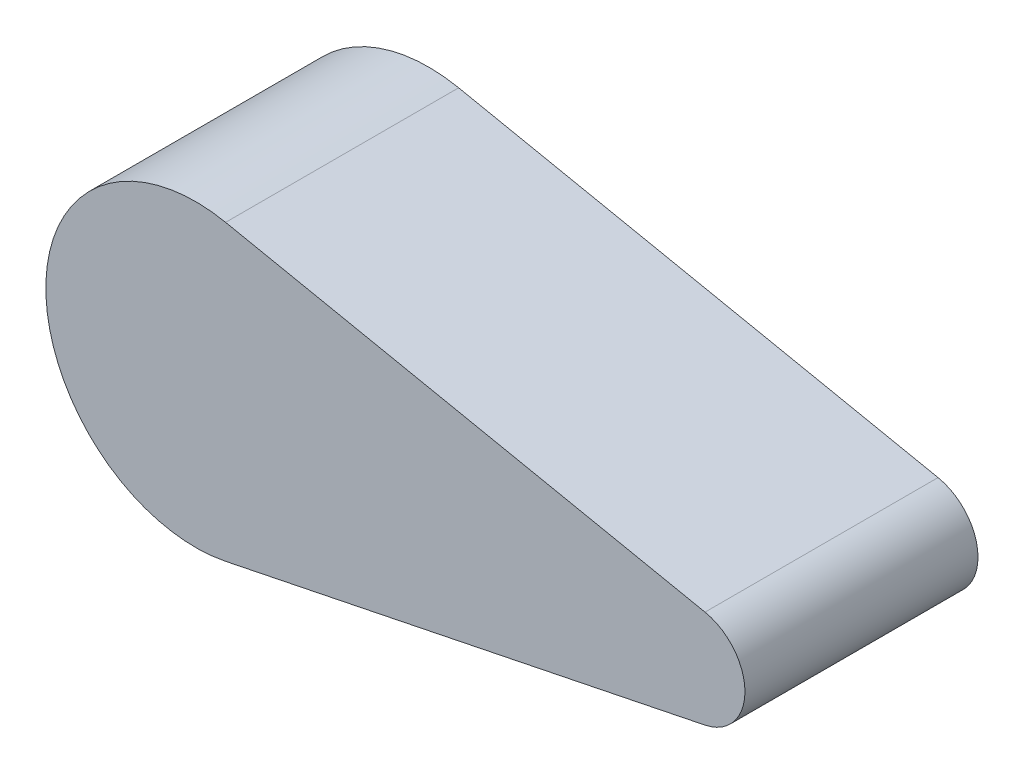
ISO-10303-21;
HEADER;
FILE_DESCRIPTION(('STEP AP214'),'2;1');
FILE_NAME('part.step','',(''),(''),'','','');
FILE_SCHEMA(('AUTOMOTIVE_DESIGN { 1 0 10303 214 1 1 1 1 }'));
ENDSEC;
DATA;
#1=APPLICATION_CONTEXT('core data for automotive mechanical design processes');
#2=APPLICATION_PROTOCOL_DEFINITION('international standard','automotive_design',2000,#1);
#3=PRODUCT_CONTEXT('',#1,'mechanical');
#4=PRODUCT('Part','Part','',(#3));
#5=PRODUCT_RELATED_PRODUCT_CATEGORY('part','',(#4));
#6=PRODUCT_DEFINITION_FORMATION('','',#4);
#7=PRODUCT_DEFINITION_CONTEXT('part definition',#1,'design');
#8=PRODUCT_DEFINITION('design','',#6,#7);
#9=PRODUCT_DEFINITION_SHAPE('','',#8);
#10=(LENGTH_UNIT() NAMED_UNIT(*) SI_UNIT(.MILLI.,.METRE.));
#11=(NAMED_UNIT(*) PLANE_ANGLE_UNIT() SI_UNIT($,.RADIAN.));
#12=(NAMED_UNIT(*) SI_UNIT($,.STERADIAN.) SOLID_ANGLE_UNIT());
#13=UNCERTAINTY_MEASURE_WITH_UNIT(LENGTH_MEASURE(1.E-05),#10,'distance_accuracy_value','');
#14=(GEOMETRIC_REPRESENTATION_CONTEXT(3) GLOBAL_UNCERTAINTY_ASSIGNED_CONTEXT((#13)) GLOBAL_UNIT_ASSIGNED_CONTEXT((#10,
#11,#12)) REPRESENTATION_CONTEXT('',''));
#15=CARTESIAN_POINT('',(0.,0.,0.));
#16=DIRECTION('',(0.,0.,1.));
#17=DIRECTION('',(1.,0.,0.));
#18=AXIS2_PLACEMENT_3D('',#15,#16,#17);
#19=CARTESIAN_POINT('',(15.,0.,7.));
#20=DIRECTION('',(0.,0.,-1.));
#21=DIRECTION('',(-1.,0.,0.));
#22=AXIS2_PLACEMENT_3D('',#19,#20,#21);
#23=CYLINDRICAL_SURFACE('',#22,1.5);
#24=CARTESIAN_POINT('',(15.,0.,0.));
#25=DIRECTION('',(0.,0.,1.));
#26=DIRECTION('',(1.,0.,0.));
#27=AXIS2_PLACEMENT_3D('',#24,#25,#26);
#28=CIRCLE('',#27,1.5);
#29=CARTESIAN_POINT('',(15.3,-1.46969384566991,0.));
#30=VERTEX_POINT('',#29);
#31=CARTESIAN_POINT('',(15.3,1.46969384566991,0.));
#32=VERTEX_POINT('',#31);
#33=EDGE_CURVE('E101',#30,#32,#28,.T.);
#34=ORIENTED_EDGE('',*,*,#33,.T.);
#35=DIRECTION('',(0.,0.,-1.));
#36=VECTOR('',#35,1.);
#37=CARTESIAN_POINT('',(15.3,1.46969384566991,7.));
#38=LINE('',#37,#36);
#39=CARTESIAN_POINT('',(15.3,1.46969384566991,7.));
#40=VERTEX_POINT('',#39);
#41=EDGE_CURVE('E11',#40,#32,#38,.T.);
#42=ORIENTED_EDGE('',*,*,#41,.F.);
#43=CARTESIAN_POINT('',(15.,0.,7.));
#44=DIRECTION('',(0.,0.,1.));
#45=DIRECTION('',(1.,0.,0.));
#46=AXIS2_PLACEMENT_3D('',#43,#44,#45);
#47=CIRCLE('',#46,1.5);
#48=CARTESIAN_POINT('',(15.3,-1.46969384566991,7.));
#49=VERTEX_POINT('',#48);
#50=EDGE_CURVE('E89',#49,#40,#47,.T.);
#51=ORIENTED_EDGE('',*,*,#50,.F.);
#52=DIRECTION('',(0.,0.,-1.));
#53=VECTOR('',#52,1.);
#54=CARTESIAN_POINT('',(15.3,-1.46969384566991,7.));
#55=LINE('',#54,#53);
#56=EDGE_CURVE('E97',#49,#30,#55,.T.);
#57=ORIENTED_EDGE('',*,*,#56,.T.);
#58=EDGE_LOOP('',(#34,#42,#51,#57));
#59=FACE_BOUND('',#58,.T.);
#60=ADVANCED_FACE('F38',(#59),#23,.T.);
#61=CARTESIAN_POINT('',(0.9,4.40908153700972,7.));
#62=DIRECTION('',(-0.2,-0.979795897113271,0.));
#63=DIRECTION('',(0.979795897113271,-0.2,0.));
#64=AXIS2_PLACEMENT_3D('',#61,#62,#63);
#65=PLANE('',#64);
#66=DIRECTION('',(-0.979795897113271,0.2,0.));
#67=VECTOR('',#66,1.);
#68=CARTESIAN_POINT('',(0.9,4.40908153700972,0.));
#69=LINE('',#68,#67);
#70=CARTESIAN_POINT('',(0.9,4.40908153700972,0.));
#71=VERTEX_POINT('',#70);
#72=EDGE_CURVE('E93',#32,#71,#69,.T.);
#73=ORIENTED_EDGE('',*,*,#72,.T.);
#74=DIRECTION('',(0.,0.,-1.));
#75=VECTOR('',#74,1.);
#76=CARTESIAN_POINT('',(0.9,4.40908153700972,7.));
#77=LINE('',#76,#75);
#78=CARTESIAN_POINT('',(0.9,4.40908153700972,7.));
#79=VERTEX_POINT('',#78);
#80=EDGE_CURVE('E46',#79,#71,#77,.T.);
#81=ORIENTED_EDGE('',*,*,#80,.F.);
#82=DIRECTION('',(-0.979795897113271,0.2,0.));
#83=VECTOR('',#82,1.);
#84=CARTESIAN_POINT('',(0.9,4.40908153700972,7.));
#85=LINE('',#84,#83);
#86=EDGE_CURVE('E84',#40,#79,#85,.T.);
#87=ORIENTED_EDGE('',*,*,#86,.F.);
#88=ORIENTED_EDGE('',*,*,#41,.T.);
#89=EDGE_LOOP('',(#73,#81,#87,#88));
#90=FACE_BOUND('',#89,.T.);
#91=ADVANCED_FACE('F92',(#90),#65,.F.);
#92=CARTESIAN_POINT('',(0.,0.,7.));
#93=DIRECTION('',(0.,0.,-1.));
#94=DIRECTION('',(-1.,0.,0.));
#95=AXIS2_PLACEMENT_3D('',#92,#93,#94);
#96=CYLINDRICAL_SURFACE('',#95,4.5);
#97=CARTESIAN_POINT('',(0.,0.,0.));
#98=DIRECTION('',(0.,0.,1.));
#99=DIRECTION('',(1.,0.,0.));
#100=AXIS2_PLACEMENT_3D('',#97,#98,#99);
#101=CIRCLE('',#100,4.5);
#102=CARTESIAN_POINT('',(0.9,-4.40908153700972,0.));
#103=VERTEX_POINT('',#102);
#104=EDGE_CURVE('E71',#71,#103,#101,.T.);
#105=ORIENTED_EDGE('',*,*,#104,.T.);
#106=DIRECTION('',(0.,0.,-1.));
#107=VECTOR('',#106,1.);
#108=CARTESIAN_POINT('',(0.9,-4.40908153700972,7.));
#109=LINE('',#108,#107);
#110=CARTESIAN_POINT('',(0.9,-4.40908153700972,7.));
#111=VERTEX_POINT('',#110);
#112=EDGE_CURVE('E94',#111,#103,#109,.T.);
#113=ORIENTED_EDGE('',*,*,#112,.F.);
#114=CARTESIAN_POINT('',(0.,0.,7.));
#115=DIRECTION('',(0.,0.,1.));
#116=DIRECTION('',(1.,0.,0.));
#117=AXIS2_PLACEMENT_3D('',#114,#115,#116);
#118=CIRCLE('',#117,4.5);
#119=EDGE_CURVE('E87',#79,#111,#118,.T.);
#120=ORIENTED_EDGE('',*,*,#119,.F.);
#121=ORIENTED_EDGE('',*,*,#80,.T.);
#122=EDGE_LOOP('',(#105,#113,#120,#121));
#123=FACE_BOUND('',#122,.T.);
#124=ADVANCED_FACE('F95',(#123),#96,.T.);
#125=CARTESIAN_POINT('',(15.3,-1.46969384566991,7.));
#126=DIRECTION('',(-0.2,0.979795897113271,0.));
#127=DIRECTION('',(-0.979795897113271,-0.2,0.));
#128=AXIS2_PLACEMENT_3D('',#125,#126,#127);
#129=PLANE('',#128);
#130=DIRECTION('',(0.979795897113271,0.2,0.));
#131=VECTOR('',#130,1.);
#132=CARTESIAN_POINT('',(15.3,-1.46969384566991,0.));
#133=LINE('',#132,#131);
#134=EDGE_CURVE('E77',#103,#30,#133,.T.);
#135=ORIENTED_EDGE('',*,*,#134,.T.);
#136=ORIENTED_EDGE('',*,*,#56,.F.);
#137=DIRECTION('',(0.979795897113271,0.2,0.));
#138=VECTOR('',#137,1.);
#139=CARTESIAN_POINT('',(15.3,-1.46969384566991,7.));
#140=LINE('',#139,#138);
#141=EDGE_CURVE('E54',#111,#49,#140,.T.);
#142=ORIENTED_EDGE('',*,*,#141,.F.);
#143=ORIENTED_EDGE('',*,*,#112,.T.);
#144=EDGE_LOOP('',(#135,#136,#142,#143));
#145=FACE_BOUND('',#144,.T.);
#146=ADVANCED_FACE('F108',(#145),#129,.F.);
#147=CARTESIAN_POINT('',(15.,0.,7.));
#148=DIRECTION('',(0.,0.,1.));
#149=DIRECTION('',(1.,0.,0.));
#150=AXIS2_PLACEMENT_3D('',#147,#148,#149);
#151=PLANE('',#150);
#152=ORIENTED_EDGE('',*,*,#50,.T.);
#153=ORIENTED_EDGE('',*,*,#86,.T.);
#154=ORIENTED_EDGE('',*,*,#119,.T.);
#155=ORIENTED_EDGE('',*,*,#141,.T.);
#156=EDGE_LOOP('',(#152,#153,#154,#155));
#157=FACE_BOUND('',#156,.T.);
#158=ADVANCED_FACE('F85',(#157),#151,.T.);
#159=CARTESIAN_POINT('',(15.,0.,0.));
#160=DIRECTION('',(0.,0.,1.));
#161=DIRECTION('',(1.,0.,0.));
#162=AXIS2_PLACEMENT_3D('',#159,#160,#161);
#163=PLANE('',#162);
#164=ORIENTED_EDGE('',*,*,#33,.F.);
#165=ORIENTED_EDGE('',*,*,#134,.F.);
#166=ORIENTED_EDGE('',*,*,#104,.F.);
#167=ORIENTED_EDGE('',*,*,#72,.F.);
#168=EDGE_LOOP('',(#164,#165,#166,#167));
#169=FACE_BOUND('',#168,.T.);
#170=ADVANCED_FACE('F111',(#169),#163,.F.);
#171=CLOSED_SHELL('',(#60,#91,#124,#146,#158,#170));
#172=MANIFOLD_SOLID_BREP('B2',#171);
#173=ADVANCED_BREP_SHAPE_REPRESENTATION('',(#18,#172),#14);
#174=SHAPE_DEFINITION_REPRESENTATION(#9,#173);
ENDSEC;
END-ISO-10303-21;
